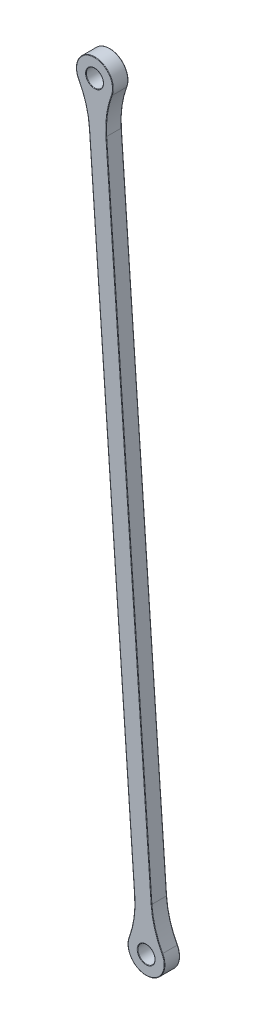
ISO-10303-21;
HEADER;
FILE_DESCRIPTION(('STEP AP214'),'2;1');
FILE_NAME('part.step','',(''),(''),'','','');
FILE_SCHEMA(('AUTOMOTIVE_DESIGN { 1 0 10303 214 1 1 1 1 }'));
ENDSEC;
DATA;
#1=APPLICATION_CONTEXT('core data for automotive mechanical design processes');
#2=APPLICATION_PROTOCOL_DEFINITION('international standard','automotive_design',2000,#1);
#3=PRODUCT_CONTEXT('',#1,'mechanical');
#4=PRODUCT('Part','Part','',(#3));
#5=PRODUCT_RELATED_PRODUCT_CATEGORY('part','',(#4));
#6=PRODUCT_DEFINITION_FORMATION('','',#4);
#7=PRODUCT_DEFINITION_CONTEXT('part definition',#1,'design');
#8=PRODUCT_DEFINITION('design','',#6,#7);
#9=PRODUCT_DEFINITION_SHAPE('','',#8);
#10=(LENGTH_UNIT() NAMED_UNIT(*) SI_UNIT(.MILLI.,.METRE.));
#11=(NAMED_UNIT(*) PLANE_ANGLE_UNIT() SI_UNIT($,.RADIAN.));
#12=(NAMED_UNIT(*) SI_UNIT($,.STERADIAN.) SOLID_ANGLE_UNIT());
#13=UNCERTAINTY_MEASURE_WITH_UNIT(LENGTH_MEASURE(1.E-05),#10,'distance_accuracy_value','');
#14=(GEOMETRIC_REPRESENTATION_CONTEXT(3) GLOBAL_UNCERTAINTY_ASSIGNED_CONTEXT((#13)) GLOBAL_UNIT_ASSIGNED_CONTEXT((#10,
#11,#12)) REPRESENTATION_CONTEXT('',''));
#15=CARTESIAN_POINT('',(0.,0.,0.));
#16=DIRECTION('',(0.,0.,1.));
#17=DIRECTION('',(1.,0.,0.));
#18=AXIS2_PLACEMENT_3D('',#15,#16,#17);
#19=CARTESIAN_POINT('',(33.0209516053081,48.5577457272989,-5.));
#20=DIRECTION('',(0.,0.,1.));
#21=DIRECTION('',(1.,0.,0.));
#22=AXIS2_PLACEMENT_3D('',#19,#20,#21);
#23=CYLINDRICAL_SURFACE('',#22,6.);
#24=DIRECTION('',(0.,0.,1.));
#25=VECTOR('',#24,1.);
#26=CARTESIAN_POINT('',(27.3940800358443,50.6406082625519,-5.));
#27=LINE('',#26,#25);
#28=CARTESIAN_POINT('',(27.3940800358443,50.6406082625519,-0.15));
#29=VERTEX_POINT('',#28);
#30=CARTESIAN_POINT('',(27.3940800358443,50.6406082625519,-4.85));
#31=VERTEX_POINT('',#30);
#32=EDGE_CURVE('E176',#29,#31,#27,.F.);
#33=ORIENTED_EDGE('',*,*,#32,.T.);
#34=CARTESIAN_POINT('',(33.0209516053081,48.5577457272989,-4.85));
#35=DIRECTION('',(0.,0.,1.));
#36=DIRECTION('',(1.,0.,0.));
#37=AXIS2_PLACEMENT_3D('',#34,#35,#36);
#38=CIRCLE('',#37,6.);
#39=CARTESIAN_POINT('',(38.3004072020363,51.4085962323544,-4.85));
#40=VERTEX_POINT('',#39);
#41=EDGE_CURVE('E235',#31,#40,#38,.T.);
#42=ORIENTED_EDGE('',*,*,#41,.T.);
#43=DIRECTION('',(0.,0.,1.));
#44=VECTOR('',#43,1.);
#45=CARTESIAN_POINT('',(38.3004072020363,51.4085962323544,-5.));
#46=LINE('',#45,#44);
#47=CARTESIAN_POINT('',(38.3004072020363,51.4085962323544,-0.15));
#48=VERTEX_POINT('',#47);
#49=EDGE_CURVE('E307',#40,#48,#46,.T.);
#50=ORIENTED_EDGE('',*,*,#49,.T.);
#51=CARTESIAN_POINT('',(33.0209516053081,48.5577457272989,-0.15));
#52=DIRECTION('',(0.,0.,1.));
#53=DIRECTION('',(1.,0.,0.));
#54=AXIS2_PLACEMENT_3D('',#51,#52,#53);
#55=CIRCLE('',#54,6.);
#56=EDGE_CURVE('E233',#48,#29,#55,.F.);
#57=ORIENTED_EDGE('',*,*,#56,.T.);
#58=EDGE_LOOP('',(#33,#42,#50,#57));
#59=FACE_BOUND('',#58,.T.);
#60=ADVANCED_FACE('F41',(#59),#23,.T.);
#61=CARTESIAN_POINT('',(33.4673478601874,2.35666142654259,-5.));
#62=DIRECTION('',(0.997529923737068,0.070242802116079,0.));
#63=DIRECTION('',(-0.070242802116079,0.997529923737068,0.));
#64=AXIS2_PLACEMENT_3D('',#61,#62,#63);
#65=PLANE('',#64);
#66=DIRECTION('',(0.,0.,1.));
#67=VECTOR('',#66,1.);
#68=CARTESIAN_POINT('',(14.4118432291919,272.967108457345,-5.));
#69=LINE('',#68,#67);
#70=CARTESIAN_POINT('',(14.4118432291919,272.967108457345,-0.15));
#71=VERTEX_POINT('',#70);
#72=CARTESIAN_POINT('',(14.4118432291919,272.967108457345,-4.85));
#73=VERTEX_POINT('',#72);
#74=EDGE_CURVE('E312',#71,#73,#69,.F.);
#75=ORIENTED_EDGE('',*,*,#74,.T.);
#76=DIRECTION('',(-0.070242802116079,0.997529923737068,0.));
#77=VECTOR('',#76,1.);
#78=CARTESIAN_POINT('',(33.4673478601874,2.35666142654259,-4.85));
#79=LINE('',#78,#77);
#80=CARTESIAN_POINT('',(29.1856199006377,63.1622050022993,-4.85));
#81=VERTEX_POINT('',#80);
#82=EDGE_CURVE('E227',#73,#81,#79,.F.);
#83=ORIENTED_EDGE('',*,*,#82,.T.);
#84=DIRECTION('',(0.,0.,1.));
#85=VECTOR('',#84,1.);
#86=CARTESIAN_POINT('',(29.1856199006377,63.1622050022993,-5.));
#87=LINE('',#86,#85);
#88=CARTESIAN_POINT('',(29.1856199006377,63.1622050022993,-0.15));
#89=VERTEX_POINT('',#88);
#90=EDGE_CURVE('E316',#81,#89,#87,.T.);
#91=ORIENTED_EDGE('',*,*,#90,.T.);
#92=DIRECTION('',(-0.070242802116079,0.997529923737068,0.));
#93=VECTOR('',#92,1.);
#94=CARTESIAN_POINT('',(14.4118432291919,272.967108457345,-0.15));
#95=LINE('',#94,#93);
#96=EDGE_CURVE('E225',#89,#71,#95,.T.);
#97=ORIENTED_EDGE('',*,*,#96,.T.);
#98=EDGE_LOOP('',(#75,#83,#91,#97));
#99=FACE_BOUND('',#98,.T.);
#100=ADVANCED_FACE('F353',(#99),#65,.F.);
#101=CARTESIAN_POINT('',(16.1626790974491,287.964927424195,-5.));
#102=DIRECTION('',(0.,0.,1.));
#103=DIRECTION('',(1.,0.,0.));
#104=AXIS2_PLACEMENT_3D('',#101,#102,#103);
#105=CYLINDRICAL_SURFACE('',#104,6.);
#106=DIRECTION('',(0.,0.,1.));
#107=VECTOR('',#106,1.);
#108=CARTESIAN_POINT('',(21.7895506669129,285.882064888942,-5.));
#109=LINE('',#108,#107);
#110=CARTESIAN_POINT('',(21.7895506669129,285.882064888942,-0.15));
#111=VERTEX_POINT('',#110);
#112=CARTESIAN_POINT('',(21.7895506669129,285.882064888942,-4.85));
#113=VERTEX_POINT('',#112);
#114=EDGE_CURVE('E347',#111,#113,#109,.F.);
#115=ORIENTED_EDGE('',*,*,#114,.T.);
#116=CARTESIAN_POINT('',(16.1626790974491,287.964927424195,-4.85));
#117=DIRECTION('',(0.,0.,1.));
#118=DIRECTION('',(1.,0.,0.));
#119=AXIS2_PLACEMENT_3D('',#116,#117,#118);
#120=CIRCLE('',#119,6.);
#121=CARTESIAN_POINT('',(10.8832235007209,285.11407691914,-4.85));
#122=VERTEX_POINT('',#121);
#123=EDGE_CURVE('E218',#113,#122,#120,.T.);
#124=ORIENTED_EDGE('',*,*,#123,.T.);
#125=DIRECTION('',(0.,0.,1.));
#126=VECTOR('',#125,1.);
#127=CARTESIAN_POINT('',(10.8832235007209,285.11407691914,-5.));
#128=LINE('',#127,#126);
#129=CARTESIAN_POINT('',(10.8832235007209,285.11407691914,-0.15));
#130=VERTEX_POINT('',#129);
#131=EDGE_CURVE('E342',#122,#130,#128,.T.);
#132=ORIENTED_EDGE('',*,*,#131,.T.);
#133=CARTESIAN_POINT('',(16.1626790974491,287.964927424195,-0.15));
#134=DIRECTION('',(0.,0.,1.));
#135=DIRECTION('',(1.,0.,0.));
#136=AXIS2_PLACEMENT_3D('',#133,#134,#135);
#137=CIRCLE('',#136,6.);
#138=EDGE_CURVE('E216',#130,#111,#137,.F.);
#139=ORIENTED_EDGE('',*,*,#138,.T.);
#140=EDGE_LOOP('',(#115,#124,#132,#139));
#141=FACE_BOUND('',#140,.T.);
#142=ADVANCED_FACE('F377',(#141),#105,.T.);
#143=CARTESIAN_POINT('',(16.1626790974491,287.964927424195,-5.));
#144=DIRECTION('',(0.,0.,1.));
#145=DIRECTION('',(1.,0.,0.));
#146=AXIS2_PLACEMENT_3D('',#143,#144,#145);
#147=CYLINDRICAL_SURFACE('',#146,2.8);
#148=CARTESIAN_POINT('',(16.1626790974491,287.964927424195,-4.85));
#149=DIRECTION('',(0.,0.,1.));
#150=DIRECTION('',(1.,0.,0.));
#151=AXIS2_PLACEMENT_3D('',#148,#149,#150);
#152=CIRCLE('',#151,2.8);
#153=CARTESIAN_POINT('',(18.9626790974491,287.964927424195,-4.85));
#154=VERTEX_POINT('',#153);
#155=EDGE_CURVE('E202',#154,#154,#152,.F.);
#156=ORIENTED_EDGE('',*,*,#155,.T.);
#157=EDGE_LOOP('',(#156));
#158=FACE_BOUND('',#157,.T.);
#159=CARTESIAN_POINT('',(16.1626790974491,287.964927424195,-0.15));
#160=DIRECTION('',(0.,0.,1.));
#161=DIRECTION('',(1.,0.,0.));
#162=AXIS2_PLACEMENT_3D('',#159,#160,#161);
#163=CIRCLE('',#162,2.8);
#164=CARTESIAN_POINT('',(18.9626790974491,287.964927424195,-0.15));
#165=VERTEX_POINT('',#164);
#166=EDGE_CURVE('E199',#165,#165,#163,.T.);
#167=ORIENTED_EDGE('',*,*,#166,.T.);
#168=EDGE_LOOP('',(#167));
#169=FACE_BOUND('',#168,.T.);
#170=ADVANCED_FACE('F646',(#158,#169),#147,.F.);
#171=CARTESIAN_POINT('',(39.053515433115,2.75002111839263,-5.));
#172=DIRECTION('',(0.997529923737068,0.070242802116079,0.));
#173=DIRECTION('',(-0.070242802116079,0.997529923737068,0.));
#174=AXIS2_PLACEMENT_3D('',#171,#172,#173);
#175=PLANE('',#174);
#176=DIRECTION('',(0.,0.,-1.));
#177=VECTOR('',#176,1.);
#178=CARTESIAN_POINT('',(34.7717874735652,63.5555646941496,-5.));
#179=LINE('',#178,#177);
#180=CARTESIAN_POINT('',(34.7717874735652,63.5555646941496,-0.15));
#181=VERTEX_POINT('',#180);
#182=CARTESIAN_POINT('',(34.7717874735652,63.5555646941496,-4.85));
#183=VERTEX_POINT('',#182);
#184=EDGE_CURVE('E270',#181,#183,#179,.T.);
#185=ORIENTED_EDGE('',*,*,#184,.T.);
#186=DIRECTION('',(-0.070242802116079,0.997529923737068,0.));
#187=VECTOR('',#186,1.);
#188=CARTESIAN_POINT('',(19.9980108021194,273.360468149195,-4.85));
#189=LINE('',#188,#187);
#190=CARTESIAN_POINT('',(19.9980108021194,273.360468149195,-4.85));
#191=VERTEX_POINT('',#190);
#192=EDGE_CURVE('E210',#183,#191,#189,.T.);
#193=ORIENTED_EDGE('',*,*,#192,.T.);
#194=DIRECTION('',(0.,0.,-1.));
#195=VECTOR('',#194,1.);
#196=CARTESIAN_POINT('',(19.9980108021194,273.360468149195,0.));
#197=LINE('',#196,#195);
#198=CARTESIAN_POINT('',(19.9980108021194,273.360468149195,-0.15));
#199=VERTEX_POINT('',#198);
#200=EDGE_CURVE('E340',#191,#199,#197,.F.);
#201=ORIENTED_EDGE('',*,*,#200,.T.);
#202=DIRECTION('',(-0.070242802116079,0.997529923737068,0.));
#203=VECTOR('',#202,1.);
#204=CARTESIAN_POINT('',(39.053515433115,2.75002111839263,-0.15));
#205=LINE('',#204,#203);
#206=EDGE_CURVE('E208',#199,#181,#205,.F.);
#207=ORIENTED_EDGE('',*,*,#206,.T.);
#208=EDGE_LOOP('',(#185,#193,#201,#207));
#209=FACE_BOUND('',#208,.T.);
#210=ADVANCED_FACE('F339',(#209),#175,.T.);
#211=CARTESIAN_POINT('',(33.0209516053081,48.5577457272989,-5.));
#212=DIRECTION('',(0.,0.,1.));
#213=DIRECTION('',(1.,0.,0.));
#214=AXIS2_PLACEMENT_3D('',#211,#212,#213);
#215=CYLINDRICAL_SURFACE('',#214,2.8);
#216=CARTESIAN_POINT('',(33.0209516053081,48.5577457272989,-4.85));
#217=DIRECTION('',(0.,0.,1.));
#218=DIRECTION('',(1.,0.,0.));
#219=AXIS2_PLACEMENT_3D('',#216,#217,#218);
#220=CIRCLE('',#219,2.8);
#221=CARTESIAN_POINT('',(35.8209516053081,48.5577457272989,-4.85));
#222=VERTEX_POINT('',#221);
#223=EDGE_CURVE('E196',#222,#222,#220,.F.);
#224=ORIENTED_EDGE('',*,*,#223,.T.);
#225=EDGE_LOOP('',(#224));
#226=FACE_BOUND('',#225,.T.);
#227=CARTESIAN_POINT('',(33.0209516053081,48.5577457272989,-0.15));
#228=DIRECTION('',(0.,0.,1.));
#229=DIRECTION('',(1.,0.,0.));
#230=AXIS2_PLACEMENT_3D('',#227,#228,#229);
#231=CIRCLE('',#230,2.8);
#232=CARTESIAN_POINT('',(35.8209516053081,48.5577457272989,-0.15));
#233=VERTEX_POINT('',#232);
#234=EDGE_CURVE('E193',#233,#233,#231,.T.);
#235=ORIENTED_EDGE('',*,*,#234,.T.);
#236=EDGE_LOOP('',(#235));
#237=FACE_BOUND('',#236,.T.);
#238=ADVANCED_FACE('F623',(#226,#237),#215,.F.);
#239=CARTESIAN_POINT('',(0.,0.,-5.));
#240=DIRECTION('',(0.,0.,1.));
#241=DIRECTION('',(1.,0.,0.));
#242=AXIS2_PLACEMENT_3D('',#239,#240,#241);
#243=PLANE('',#242);
#244=CARTESIAN_POINT('',(33.0209516053081,48.5577457272989,-5.));
#245=DIRECTION('',(0.,0.,1.));
#246=DIRECTION('',(1.,0.,0.));
#247=AXIS2_PLACEMENT_3D('',#244,#245,#246);
#248=CIRCLE('',#247,2.95);
#249=CARTESIAN_POINT('',(35.9709516053081,48.5577457272989,-5.));
#250=VERTEX_POINT('',#249);
#251=EDGE_CURVE('E185',#250,#250,#248,.T.);
#252=ORIENTED_EDGE('',*,*,#251,.T.);
#253=EDGE_LOOP('',(#252));
#254=FACE_BOUND('',#253,.T.);
#255=CARTESIAN_POINT('',(16.1626790974491,287.964927424195,-5.));
#256=DIRECTION('',(0.,0.,1.));
#257=DIRECTION('',(1.,0.,0.));
#258=AXIS2_PLACEMENT_3D('',#255,#256,#257);
#259=CIRCLE('',#258,2.95);
#260=CARTESIAN_POINT('',(19.1126790974491,287.964927424195,-5.));
#261=VERTEX_POINT('',#260);
#262=EDGE_CURVE('E182',#261,#261,#259,.T.);
#263=ORIENTED_EDGE('',*,*,#262,.T.);
#264=EDGE_LOOP('',(#263));
#265=FACE_BOUND('',#264,.T.);
#266=DIRECTION('',(-0.070242802116079,0.997529923737068,0.));
#267=VECTOR('',#266,1.);
#268=CARTESIAN_POINT('',(34.6221579850047,63.5450282738321,-5.));
#269=LINE('',#268,#267);
#270=CARTESIAN_POINT('',(19.8483813135589,273.349931728877,-5.));
#271=VERTEX_POINT('',#270);
#272=CARTESIAN_POINT('',(34.6221579850047,63.5450282738321,-5.));
#273=VERTEX_POINT('',#272);
#274=EDGE_CURVE('E180',#271,#273,#269,.F.);
#275=ORIENTED_EDGE('',*,*,#274,.T.);
#276=CARTESIAN_POINT('',(64.6976851856773,65.6628487576319,-5.));
#277=DIRECTION('',(0.,0.,1.));
#278=DIRECTION('',(1.,0.,0.));
#279=AXIS2_PLACEMENT_3D('',#276,#277,#278);
#280=CIRCLE('',#279,30.15);
#281=CARTESIAN_POINT('',(38.1684208121181,51.337324969728,-5.));
#282=VERTEX_POINT('',#281);
#283=EDGE_CURVE('E161',#273,#282,#280,.T.);
#284=ORIENTED_EDGE('',*,*,#283,.T.);
#285=CARTESIAN_POINT('',(33.0209516053081,48.5577457272989,-5.));
#286=DIRECTION('',(0.,0.,1.));
#287=DIRECTION('',(1.,0.,0.));
#288=AXIS2_PLACEMENT_3D('',#285,#286,#287);
#289=CIRCLE('',#288,5.85);
#290=CARTESIAN_POINT('',(27.5347518250809,50.5885366991706,-5.));
#291=VERTEX_POINT('',#290);
#292=EDGE_CURVE('E169',#282,#291,#289,.F.);
#293=ORIENTED_EDGE('',*,*,#292,.T.);
#294=CARTESIAN_POINT('',(-0.740277811474392,61.054920938817,-5.));
#295=DIRECTION('',(0.,0.,1.));
#296=DIRECTION('',(1.,0.,0.));
#297=AXIS2_PLACEMENT_3D('',#294,#295,#296);
#298=CIRCLE('',#297,30.15);
#299=CARTESIAN_POINT('',(29.3352493891982,63.1727414226168,-5.));
#300=VERTEX_POINT('',#299);
#301=EDGE_CURVE('E175',#291,#300,#298,.T.);
#302=ORIENTED_EDGE('',*,*,#301,.T.);
#303=DIRECTION('',(-0.070242802116079,0.997529923737068,0.));
#304=VECTOR('',#303,1.);
#305=CARTESIAN_POINT('',(33.6169773487479,2.36719784686,-5.));
#306=LINE('',#305,#304);
#307=CARTESIAN_POINT('',(14.5614727177524,272.977644877662,-5.));
#308=VERTEX_POINT('',#307);
#309=EDGE_CURVE('E321',#300,#308,#306,.T.);
#310=ORIENTED_EDGE('',*,*,#309,.T.);
#311=CARTESIAN_POINT('',(-15.5140544829202,270.859824393862,-5.));
#312=DIRECTION('',(0.,0.,1.));
#313=DIRECTION('',(1.,0.,0.));
#314=AXIS2_PLACEMENT_3D('',#311,#312,#313);
#315=CIRCLE('',#314,30.15);
#316=CARTESIAN_POINT('',(11.0152098906391,285.185348181766,-5.));
#317=VERTEX_POINT('',#316);
#318=EDGE_CURVE('E323',#308,#317,#315,.T.);
#319=ORIENTED_EDGE('',*,*,#318,.T.);
#320=CARTESIAN_POINT('',(16.1626790974491,287.964927424195,-5.));
#321=DIRECTION('',(0.,0.,1.));
#322=DIRECTION('',(1.,0.,0.));
#323=AXIS2_PLACEMENT_3D('',#320,#321,#322);
#324=CIRCLE('',#323,5.85);
#325=CARTESIAN_POINT('',(21.6488788776763,285.934136452324,-5.));
#326=VERTEX_POINT('',#325);
#327=EDGE_CURVE('E325',#317,#326,#324,.F.);
#328=ORIENTED_EDGE('',*,*,#327,.T.);
#329=CARTESIAN_POINT('',(49.9239085142315,275.467752212677,-5.));
#330=DIRECTION('',(0.,0.,1.));
#331=DIRECTION('',(1.,0.,0.));
#332=AXIS2_PLACEMENT_3D('',#329,#330,#331);
#333=CIRCLE('',#332,30.15);
#334=EDGE_CURVE('E187',#326,#271,#333,.T.);
#335=ORIENTED_EDGE('',*,*,#334,.T.);
#336=EDGE_LOOP('',(#275,#284,#293,#302,#310,#319,#328,#335));
#337=FACE_BOUND('',#336,.T.);
#338=ADVANCED_FACE('F178',(#254,#265,#337),#243,.F.);
#339=CARTESIAN_POINT('',(0.,0.,0.));
#340=DIRECTION('',(0.,0.,1.));
#341=DIRECTION('',(1.,0.,0.));
#342=AXIS2_PLACEMENT_3D('',#339,#340,#341);
#343=PLANE('',#342);
#344=CARTESIAN_POINT('',(33.0209516053081,48.5577457272989,0.));
#345=DIRECTION('',(0.,0.,1.));
#346=DIRECTION('',(1.,0.,0.));
#347=AXIS2_PLACEMENT_3D('',#344,#345,#346);
#348=CIRCLE('',#347,2.95);
#349=CARTESIAN_POINT('',(35.9709516053081,48.5577457272989,0.));
#350=VERTEX_POINT('',#349);
#351=EDGE_CURVE('E11',#350,#350,#348,.F.);
#352=ORIENTED_EDGE('',*,*,#351,.T.);
#353=EDGE_LOOP('',(#352));
#354=FACE_BOUND('',#353,.T.);
#355=CARTESIAN_POINT('',(16.1626790974491,287.964927424195,0.));
#356=DIRECTION('',(0.,0.,1.));
#357=DIRECTION('',(1.,0.,0.));
#358=AXIS2_PLACEMENT_3D('',#355,#356,#357);
#359=CIRCLE('',#358,2.95);
#360=CARTESIAN_POINT('',(19.1126790974491,287.964927424195,0.));
#361=VERTEX_POINT('',#360);
#362=EDGE_CURVE('E50',#361,#361,#359,.F.);
#363=ORIENTED_EDGE('',*,*,#362,.T.);
#364=EDGE_LOOP('',(#363));
#365=FACE_BOUND('',#364,.T.);
#366=CARTESIAN_POINT('',(16.1626790974491,287.964927424195,0.));
#367=DIRECTION('',(0.,0.,1.));
#368=DIRECTION('',(1.,0.,0.));
#369=AXIS2_PLACEMENT_3D('',#366,#367,#368);
#370=CIRCLE('',#369,5.85);
#371=CARTESIAN_POINT('',(21.6488788776762,285.934136452324,0.));
#372=VERTEX_POINT('',#371);
#373=CARTESIAN_POINT('',(11.0152098906391,285.185348181766,0.));
#374=VERTEX_POINT('',#373);
#375=EDGE_CURVE('E58',#372,#374,#370,.T.);
#376=ORIENTED_EDGE('',*,*,#375,.T.);
#377=CARTESIAN_POINT('',(-15.5140544829202,270.859824393862,0.));
#378=DIRECTION('',(0.,0.,1.));
#379=DIRECTION('',(1.,0.,0.));
#380=AXIS2_PLACEMENT_3D('',#377,#378,#379);
#381=CIRCLE('',#380,30.15);
#382=CARTESIAN_POINT('',(14.5614727177524,272.977644877662,0.));
#383=VERTEX_POINT('',#382);
#384=EDGE_CURVE('E249',#374,#383,#381,.F.);
#385=ORIENTED_EDGE('',*,*,#384,.T.);
#386=DIRECTION('',(-0.070242802116079,0.997529923737068,0.));
#387=VECTOR('',#386,1.);
#388=CARTESIAN_POINT('',(29.3352493891982,63.1727414226168,0.));
#389=LINE('',#388,#387);
#390=CARTESIAN_POINT('',(29.3352493891982,63.1727414226168,0.));
#391=VERTEX_POINT('',#390);
#392=EDGE_CURVE('E237',#383,#391,#389,.F.);
#393=ORIENTED_EDGE('',*,*,#392,.T.);
#394=CARTESIAN_POINT('',(-0.740277811474392,61.054920938817,0.));
#395=DIRECTION('',(0.,0.,1.));
#396=DIRECTION('',(1.,0.,0.));
#397=AXIS2_PLACEMENT_3D('',#394,#395,#396);
#398=CIRCLE('',#397,30.15);
#399=CARTESIAN_POINT('',(27.5347518250809,50.5885366991706,0.));
#400=VERTEX_POINT('',#399);
#401=EDGE_CURVE('E239',#391,#400,#398,.F.);
#402=ORIENTED_EDGE('',*,*,#401,.T.);
#403=CARTESIAN_POINT('',(33.0209516053081,48.5577457272989,0.));
#404=DIRECTION('',(0.,0.,1.));
#405=DIRECTION('',(1.,0.,0.));
#406=AXIS2_PLACEMENT_3D('',#403,#404,#405);
#407=CIRCLE('',#406,5.85);
#408=CARTESIAN_POINT('',(38.1684208121181,51.337324969728,0.));
#409=VERTEX_POINT('',#408);
#410=EDGE_CURVE('E241',#400,#409,#407,.T.);
#411=ORIENTED_EDGE('',*,*,#410,.T.);
#412=CARTESIAN_POINT('',(64.6976851856773,65.6628487576319,0.));
#413=DIRECTION('',(0.,0.,1.));
#414=DIRECTION('',(1.,0.,0.));
#415=AXIS2_PLACEMENT_3D('',#412,#413,#414);
#416=CIRCLE('',#415,30.15);
#417=CARTESIAN_POINT('',(34.6221579850047,63.5450282738321,0.));
#418=VERTEX_POINT('',#417);
#419=EDGE_CURVE('E243',#409,#418,#416,.F.);
#420=ORIENTED_EDGE('',*,*,#419,.T.);
#421=DIRECTION('',(-0.070242802116079,0.997529923737068,0.));
#422=VECTOR('',#421,1.);
#423=CARTESIAN_POINT('',(38.9038859445544,2.73948469807522,0.));
#424=LINE('',#423,#422);
#425=CARTESIAN_POINT('',(19.8483813135589,273.349931728877,0.));
#426=VERTEX_POINT('',#425);
#427=EDGE_CURVE('E245',#418,#426,#424,.T.);
#428=ORIENTED_EDGE('',*,*,#427,.T.);
#429=CARTESIAN_POINT('',(49.9239085142315,275.467752212677,0.));
#430=DIRECTION('',(0.,0.,1.));
#431=DIRECTION('',(1.,0.,0.));
#432=AXIS2_PLACEMENT_3D('',#429,#430,#431);
#433=CIRCLE('',#432,30.15);
#434=EDGE_CURVE('E63',#426,#372,#433,.F.);
#435=ORIENTED_EDGE('',*,*,#434,.T.);
#436=EDGE_LOOP('',(#376,#385,#393,#402,#411,#420,#428,#435));
#437=FACE_BOUND('',#436,.T.);
#438=ADVANCED_FACE('F396',(#354,#365,#437),#343,.T.);
#439=CARTESIAN_POINT('',(49.9239085142315,275.467752212677,-5.));
#440=DIRECTION('',(0.,0.,1.));
#441=DIRECTION('',(1.,0.,0.));
#442=AXIS2_PLACEMENT_3D('',#439,#440,#441);
#443=CYLINDRICAL_SURFACE('',#442,30.);
#444=ORIENTED_EDGE('',*,*,#200,.F.);
#445=CARTESIAN_POINT('',(49.9239085142315,275.467752212677,-4.85));
#446=DIRECTION('',(0.,0.,1.));
#447=DIRECTION('',(1.,0.,0.));
#448=AXIS2_PLACEMENT_3D('',#445,#446,#447);
#449=CIRCLE('',#448,30.);
#450=EDGE_CURVE('E214',#191,#113,#449,.F.);
#451=ORIENTED_EDGE('',*,*,#450,.T.);
#452=ORIENTED_EDGE('',*,*,#114,.F.);
#453=CARTESIAN_POINT('',(49.9239085142315,275.467752212677,-0.15));
#454=DIRECTION('',(0.,0.,1.));
#455=DIRECTION('',(1.,0.,0.));
#456=AXIS2_PLACEMENT_3D('',#453,#454,#455);
#457=CIRCLE('',#456,30.);
#458=EDGE_CURVE('E212',#111,#199,#457,.T.);
#459=ORIENTED_EDGE('',*,*,#458,.T.);
#460=EDGE_LOOP('',(#444,#451,#452,#459));
#461=FACE_BOUND('',#460,.T.);
#462=ADVANCED_FACE('F419',(#461),#443,.F.);
#463=CARTESIAN_POINT('',(-15.5140544829202,270.859824393862,-5.));
#464=DIRECTION('',(0.,0.,1.));
#465=DIRECTION('',(1.,0.,0.));
#466=AXIS2_PLACEMENT_3D('',#463,#464,#465);
#467=CYLINDRICAL_SURFACE('',#466,30.);
#468=ORIENTED_EDGE('',*,*,#131,.F.);
#469=CARTESIAN_POINT('',(-15.5140544829202,270.859824393862,-4.85));
#470=DIRECTION('',(0.,0.,1.));
#471=DIRECTION('',(1.,0.,0.));
#472=AXIS2_PLACEMENT_3D('',#469,#470,#471);
#473=CIRCLE('',#472,30.);
#474=EDGE_CURVE('E223',#122,#73,#473,.F.);
#475=ORIENTED_EDGE('',*,*,#474,.T.);
#476=ORIENTED_EDGE('',*,*,#74,.F.);
#477=CARTESIAN_POINT('',(-15.5140544829202,270.859824393862,-0.15));
#478=DIRECTION('',(0.,0.,1.));
#479=DIRECTION('',(1.,0.,0.));
#480=AXIS2_PLACEMENT_3D('',#477,#478,#479);
#481=CIRCLE('',#480,30.);
#482=EDGE_CURVE('E220',#71,#130,#481,.T.);
#483=ORIENTED_EDGE('',*,*,#482,.T.);
#484=EDGE_LOOP('',(#468,#475,#476,#483));
#485=FACE_BOUND('',#484,.T.);
#486=ADVANCED_FACE('F374',(#485),#467,.F.);
#487=CARTESIAN_POINT('',(-0.740277811474392,61.054920938817,-5.));
#488=DIRECTION('',(0.,0.,1.));
#489=DIRECTION('',(1.,0.,0.));
#490=AXIS2_PLACEMENT_3D('',#487,#488,#489);
#491=CYLINDRICAL_SURFACE('',#490,30.);
#492=ORIENTED_EDGE('',*,*,#90,.F.);
#493=CARTESIAN_POINT('',(-0.740277811474392,61.054920938817,-4.85));
#494=DIRECTION('',(0.,0.,1.));
#495=DIRECTION('',(1.,0.,0.));
#496=AXIS2_PLACEMENT_3D('',#493,#494,#495);
#497=CIRCLE('',#496,30.);
#498=EDGE_CURVE('E231',#81,#31,#497,.F.);
#499=ORIENTED_EDGE('',*,*,#498,.T.);
#500=ORIENTED_EDGE('',*,*,#32,.F.);
#501=CARTESIAN_POINT('',(-0.740277811474392,61.054920938817,-0.15));
#502=DIRECTION('',(0.,0.,1.));
#503=DIRECTION('',(1.,0.,0.));
#504=AXIS2_PLACEMENT_3D('',#501,#502,#503);
#505=CIRCLE('',#504,30.);
#506=EDGE_CURVE('E229',#29,#89,#505,.T.);
#507=ORIENTED_EDGE('',*,*,#506,.T.);
#508=EDGE_LOOP('',(#492,#499,#500,#507));
#509=FACE_BOUND('',#508,.T.);
#510=ADVANCED_FACE('F393',(#509),#491,.F.);
#511=CARTESIAN_POINT('',(64.6976851856773,65.6628487576319,-5.));
#512=DIRECTION('',(0.,0.,1.));
#513=DIRECTION('',(1.,0.,0.));
#514=AXIS2_PLACEMENT_3D('',#511,#512,#513);
#515=CYLINDRICAL_SURFACE('',#514,30.);
#516=ORIENTED_EDGE('',*,*,#49,.F.);
#517=CARTESIAN_POINT('',(64.6976851856773,65.6628487576319,-4.85));
#518=DIRECTION('',(0.,0.,1.));
#519=DIRECTION('',(1.,0.,0.));
#520=AXIS2_PLACEMENT_3D('',#517,#518,#519);
#521=CIRCLE('',#520,30.);
#522=EDGE_CURVE('E163',#40,#183,#521,.F.);
#523=ORIENTED_EDGE('',*,*,#522,.T.);
#524=ORIENTED_EDGE('',*,*,#184,.F.);
#525=CARTESIAN_POINT('',(64.6976851856773,65.6628487576319,-0.15));
#526=DIRECTION('',(0.,0.,1.));
#527=DIRECTION('',(1.,0.,0.));
#528=AXIS2_PLACEMENT_3D('',#525,#526,#527);
#529=CIRCLE('',#528,30.);
#530=EDGE_CURVE('E205',#181,#48,#529,.T.);
#531=ORIENTED_EDGE('',*,*,#530,.T.);
#532=EDGE_LOOP('',(#516,#523,#524,#531));
#533=FACE_BOUND('',#532,.T.);
#534=ADVANCED_FACE('F306',(#533),#515,.F.);
#535=CARTESIAN_POINT('',(33.0209516053081,48.5577457272989,-4.85));
#536=DIRECTION('',(0.,0.,1.));
#537=DIRECTION('',(1.,0.,0.));
#538=AXIS2_PLACEMENT_3D('',#535,#536,#537);
#539=TOROIDAL_SURFACE('',#538,2.95,0.15);
#540=ORIENTED_EDGE('',*,*,#223,.F.);
#541=EDGE_LOOP('',(#540));
#542=FACE_BOUND('',#541,.T.);
#543=ORIENTED_EDGE('',*,*,#251,.F.);
#544=EDGE_LOOP('',(#543));
#545=FACE_BOUND('',#544,.T.);
#546=ADVANCED_FACE('F429',(#542,#545),#539,.T.);
#547=CARTESIAN_POINT('',(16.1626790974491,287.964927424195,-4.85));
#548=DIRECTION('',(0.,0.,1.));
#549=DIRECTION('',(1.,0.,0.));
#550=AXIS2_PLACEMENT_3D('',#547,#548,#549);
#551=TOROIDAL_SURFACE('',#550,2.95,0.15);
#552=ORIENTED_EDGE('',*,*,#155,.F.);
#553=EDGE_LOOP('',(#552));
#554=FACE_BOUND('',#553,.T.);
#555=ORIENTED_EDGE('',*,*,#262,.F.);
#556=EDGE_LOOP('',(#555));
#557=FACE_BOUND('',#556,.T.);
#558=ADVANCED_FACE('F432',(#554,#557),#551,.T.);
#559=CARTESIAN_POINT('',(-15.5140544829202,270.859824393862,-4.85));
#560=DIRECTION('',(0.,0.,1.));
#561=DIRECTION('',(1.,0.,0.));
#562=AXIS2_PLACEMENT_3D('',#559,#560,#561);
#563=TOROIDAL_SURFACE('',#562,30.15,0.15);
#564=CARTESIAN_POINT('',(14.5614727177524,272.977644877662,-4.85));
#565=DIRECTION('',(0.0702428021159834,-0.997529923737075,0.));
#566=DIRECTION('',(0.997529923737075,0.0702428021159834,0.));
#567=AXIS2_PLACEMENT_3D('',#564,#565,#566);
#568=CIRCLE('',#567,0.15);
#569=EDGE_CURVE('E264',#73,#308,#568,.T.);
#570=ORIENTED_EDGE('',*,*,#569,.F.);
#571=ORIENTED_EDGE('',*,*,#474,.F.);
#572=CARTESIAN_POINT('',(11.0152098906391,285.185348181766,-4.85));
#573=DIRECTION('',(-0.475141750842693,0.879909266121309,0.));
#574=DIRECTION('',(-0.879909266121309,-0.475141750842693,0.));
#575=AXIS2_PLACEMENT_3D('',#572,#573,#574);
#576=CIRCLE('',#575,0.15);
#577=EDGE_CURVE('E267',#317,#122,#576,.T.);
#578=ORIENTED_EDGE('',*,*,#577,.F.);
#579=ORIENTED_EDGE('',*,*,#318,.F.);
#580=EDGE_LOOP('',(#570,#571,#578,#579));
#581=FACE_BOUND('',#580,.T.);
#582=ADVANCED_FACE('F386',(#581),#563,.T.);
#583=CARTESIAN_POINT('',(16.1626790974491,287.964927424195,-4.85));
#584=DIRECTION('',(0.,0.,1.));
#585=DIRECTION('',(1.,0.,0.));
#586=AXIS2_PLACEMENT_3D('',#583,#584,#585);
#587=TOROIDAL_SURFACE('',#586,5.85,0.15);
#588=ORIENTED_EDGE('',*,*,#577,.T.);
#589=ORIENTED_EDGE('',*,*,#123,.F.);
#590=CARTESIAN_POINT('',(21.6488788776763,285.934136452324,-4.85));
#591=DIRECTION('',(-0.347143755875526,-0.937811928243949,0.));
#592=DIRECTION('',(0.937811928243949,-0.347143755875526,0.));
#593=AXIS2_PLACEMENT_3D('',#590,#591,#592);
#594=CIRCLE('',#593,0.15);
#595=EDGE_CURVE('E261',#326,#113,#594,.T.);
#596=ORIENTED_EDGE('',*,*,#595,.F.);
#597=ORIENTED_EDGE('',*,*,#327,.F.);
#598=EDGE_LOOP('',(#588,#589,#596,#597));
#599=FACE_BOUND('',#598,.T.);
#600=ADVANCED_FACE('F381',(#599),#587,.T.);
#601=CARTESIAN_POINT('',(33.6169773487479,2.36719784686,-4.85));
#602=DIRECTION('',(-0.070242802116079,0.997529923737068,0.));
#603=DIRECTION('',(-0.997529923737068,-0.070242802116079,0.));
#604=AXIS2_PLACEMENT_3D('',#601,#602,#603);
#605=CYLINDRICAL_SURFACE('',#604,0.15);
#606=ORIENTED_EDGE('',*,*,#569,.T.);
#607=ORIENTED_EDGE('',*,*,#309,.F.);
#608=CARTESIAN_POINT('',(29.3352493891982,63.1727414226168,-4.85));
#609=DIRECTION('',(0.0702428021160746,-0.997529923737069,0.));
#610=DIRECTION('',(0.997529923737069,0.0702428021160747,0.));
#611=AXIS2_PLACEMENT_3D('',#608,#609,#610);
#612=CIRCLE('',#611,0.15);
#613=EDGE_CURVE('E258',#81,#300,#612,.T.);
#614=ORIENTED_EDGE('',*,*,#613,.F.);
#615=ORIENTED_EDGE('',*,*,#82,.F.);
#616=EDGE_LOOP('',(#606,#607,#614,#615));
#617=FACE_BOUND('',#616,.T.);
#618=ADVANCED_FACE('F389',(#617),#605,.T.);
#619=CARTESIAN_POINT('',(49.9239085142315,275.467752212677,-4.85));
#620=DIRECTION('',(0.,0.,1.));
#621=DIRECTION('',(1.,0.,0.));
#622=AXIS2_PLACEMENT_3D('',#619,#620,#621);
#623=TOROIDAL_SURFACE('',#622,30.15,0.15);
#624=ORIENTED_EDGE('',*,*,#595,.T.);
#625=ORIENTED_EDGE('',*,*,#450,.F.);
#626=CARTESIAN_POINT('',(19.8483813135589,273.349931728877,-4.85));
#627=DIRECTION('',(0.0702428021159842,-0.997529923737075,0.));
#628=DIRECTION('',(0.997529923737075,0.0702428021159842,0.));
#629=AXIS2_PLACEMENT_3D('',#626,#627,#628);
#630=CIRCLE('',#629,0.15);
#631=EDGE_CURVE('E255',#271,#191,#630,.T.);
#632=ORIENTED_EDGE('',*,*,#631,.F.);
#633=ORIENTED_EDGE('',*,*,#334,.F.);
#634=EDGE_LOOP('',(#624,#625,#632,#633));
#635=FACE_BOUND('',#634,.T.);
#636=ADVANCED_FACE('F332',(#635),#623,.T.);
#637=CARTESIAN_POINT('',(-0.740277811474392,61.054920938817,-4.85));
#638=DIRECTION('',(0.,0.,1.));
#639=DIRECTION('',(1.,0.,0.));
#640=AXIS2_PLACEMENT_3D('',#637,#638,#639);
#641=TOROIDAL_SURFACE('',#640,30.15,0.15);
#642=ORIENTED_EDGE('',*,*,#613,.T.);
#643=ORIENTED_EDGE('',*,*,#301,.F.);
#644=CARTESIAN_POINT('',(27.5347518250809,50.5885366991706,-4.85));
#645=DIRECTION('',(-0.347143755875518,-0.937811928243952,0.));
#646=DIRECTION('',(0.937811928243952,-0.347143755875518,0.));
#647=AXIS2_PLACEMENT_3D('',#644,#645,#646);
#648=CIRCLE('',#647,0.15);
#649=EDGE_CURVE('E172',#31,#291,#648,.T.);
#650=ORIENTED_EDGE('',*,*,#649,.F.);
#651=ORIENTED_EDGE('',*,*,#498,.F.);
#652=EDGE_LOOP('',(#642,#643,#650,#651));
#653=FACE_BOUND('',#652,.T.);
#654=ADVANCED_FACE('F392',(#653),#641,.T.);
#655=CARTESIAN_POINT('',(38.9038859445544,2.73948469807522,-4.85));
#656=DIRECTION('',(0.070242802116079,-0.997529923737068,0.));
#657=DIRECTION('',(0.997529923737068,0.070242802116079,0.));
#658=AXIS2_PLACEMENT_3D('',#655,#656,#657);
#659=CYLINDRICAL_SURFACE('',#658,0.15);
#660=ORIENTED_EDGE('',*,*,#631,.T.);
#661=ORIENTED_EDGE('',*,*,#192,.F.);
#662=CARTESIAN_POINT('',(34.6221579850047,63.5450282738321,-4.85));
#663=DIRECTION('',(0.0702428021160763,-0.997529923737069,0.));
#664=DIRECTION('',(0.997529923737069,0.0702428021160763,0.));
#665=AXIS2_PLACEMENT_3D('',#662,#663,#664);
#666=CIRCLE('',#665,0.15);
#667=EDGE_CURVE('E166',#273,#183,#666,.T.);
#668=ORIENTED_EDGE('',*,*,#667,.F.);
#669=ORIENTED_EDGE('',*,*,#274,.F.);
#670=EDGE_LOOP('',(#660,#661,#668,#669));
#671=FACE_BOUND('',#670,.T.);
#672=ADVANCED_FACE('F335',(#671),#659,.T.);
#673=CARTESIAN_POINT('',(33.0209516053081,48.5577457272989,-4.85));
#674=DIRECTION('',(0.,0.,1.));
#675=DIRECTION('',(1.,0.,0.));
#676=AXIS2_PLACEMENT_3D('',#673,#674,#675);
#677=TOROIDAL_SURFACE('',#676,5.85,0.15);
#678=ORIENTED_EDGE('',*,*,#649,.T.);
#679=ORIENTED_EDGE('',*,*,#292,.F.);
#680=CARTESIAN_POINT('',(38.1684208121181,51.337324969728,-4.85));
#681=DIRECTION('',(-0.475141750842607,0.879909266121355,0.));
#682=DIRECTION('',(-0.879909266121355,-0.475141750842607,0.));
#683=AXIS2_PLACEMENT_3D('',#680,#681,#682);
#684=CIRCLE('',#683,0.15);
#685=EDGE_CURVE('E157',#40,#282,#684,.T.);
#686=ORIENTED_EDGE('',*,*,#685,.F.);
#687=ORIENTED_EDGE('',*,*,#41,.F.);
#688=EDGE_LOOP('',(#678,#679,#686,#687));
#689=FACE_BOUND('',#688,.T.);
#690=ADVANCED_FACE('F170',(#689),#677,.T.);
#691=CARTESIAN_POINT('',(64.6976851856773,65.6628487576319,-4.85));
#692=DIRECTION('',(0.,0.,1.));
#693=DIRECTION('',(1.,0.,0.));
#694=AXIS2_PLACEMENT_3D('',#691,#692,#693);
#695=TOROIDAL_SURFACE('',#694,30.15,0.15);
#696=ORIENTED_EDGE('',*,*,#667,.T.);
#697=ORIENTED_EDGE('',*,*,#522,.F.);
#698=ORIENTED_EDGE('',*,*,#685,.T.);
#699=ORIENTED_EDGE('',*,*,#283,.F.);
#700=EDGE_LOOP('',(#696,#697,#698,#699));
#701=FACE_BOUND('',#700,.T.);
#702=ADVANCED_FACE('F159',(#701),#695,.T.);
#703=CARTESIAN_POINT('',(33.0209516053081,48.5577457272989,-0.15));
#704=DIRECTION('',(0.,0.,1.));
#705=DIRECTION('',(1.,0.,0.));
#706=AXIS2_PLACEMENT_3D('',#703,#704,#705);
#707=TOROIDAL_SURFACE('',#706,2.95,0.15);
#708=ORIENTED_EDGE('',*,*,#351,.F.);
#709=EDGE_LOOP('',(#708));
#710=FACE_BOUND('',#709,.T.);
#711=ORIENTED_EDGE('',*,*,#234,.F.);
#712=EDGE_LOOP('',(#711));
#713=FACE_BOUND('',#712,.T.);
#714=ADVANCED_FACE('F439',(#710,#713),#707,.T.);
#715=CARTESIAN_POINT('',(16.1626790974491,287.964927424195,-0.15));
#716=DIRECTION('',(0.,0.,1.));
#717=DIRECTION('',(1.,0.,0.));
#718=AXIS2_PLACEMENT_3D('',#715,#716,#717);
#719=TOROIDAL_SURFACE('',#718,2.95,0.15);
#720=ORIENTED_EDGE('',*,*,#362,.F.);
#721=EDGE_LOOP('',(#720));
#722=FACE_BOUND('',#721,.T.);
#723=ORIENTED_EDGE('',*,*,#166,.F.);
#724=EDGE_LOOP('',(#723));
#725=FACE_BOUND('',#724,.T.);
#726=ADVANCED_FACE('F456',(#722,#725),#719,.T.);
#727=CARTESIAN_POINT('',(64.6976851856773,65.6628487576319,-0.15));
#728=DIRECTION('',(0.,0.,1.));
#729=DIRECTION('',(1.,0.,0.));
#730=AXIS2_PLACEMENT_3D('',#727,#728,#729);
#731=TOROIDAL_SURFACE('',#730,30.15,0.15);
#732=CARTESIAN_POINT('',(38.1684208121181,51.337324969728,-0.15));
#733=DIRECTION('',(0.475141750842607,-0.879909266121355,0.));
#734=DIRECTION('',(0.879909266121355,0.475141750842607,0.));
#735=AXIS2_PLACEMENT_3D('',#732,#733,#734);
#736=CIRCLE('',#735,0.15);
#737=EDGE_CURVE('E286',#48,#409,#736,.T.);
#738=ORIENTED_EDGE('',*,*,#737,.F.);
#739=ORIENTED_EDGE('',*,*,#530,.F.);
#740=CARTESIAN_POINT('',(34.6221579850047,63.5450282738321,-0.15));
#741=DIRECTION('',(-0.070242802116073,0.997529923737069,0.));
#742=DIRECTION('',(-0.997529923737069,-0.070242802116073,0.));
#743=AXIS2_PLACEMENT_3D('',#740,#741,#742);
#744=CIRCLE('',#743,0.15);
#745=EDGE_CURVE('E45',#418,#181,#744,.T.);
#746=ORIENTED_EDGE('',*,*,#745,.F.);
#747=ORIENTED_EDGE('',*,*,#419,.F.);
#748=EDGE_LOOP('',(#738,#739,#746,#747));
#749=FACE_BOUND('',#748,.T.);
#750=ADVANCED_FACE('F43',(#749),#731,.T.);
#751=CARTESIAN_POINT('',(38.9038859445544,2.73948469807522,-0.15));
#752=DIRECTION('',(-0.070242802116079,0.997529923737068,0.));
#753=DIRECTION('',(-0.997529923737068,-0.070242802116079,0.));
#754=AXIS2_PLACEMENT_3D('',#751,#752,#753);
#755=CYLINDRICAL_SURFACE('',#754,0.15);
#756=ORIENTED_EDGE('',*,*,#745,.T.);
#757=ORIENTED_EDGE('',*,*,#206,.F.);
#758=CARTESIAN_POINT('',(19.8483813135589,273.349931728877,-0.15));
#759=DIRECTION('',(-0.0702428021159842,0.997529923737075,0.));
#760=DIRECTION('',(-0.997529923737075,-0.0702428021159842,0.));
#761=AXIS2_PLACEMENT_3D('',#758,#759,#760);
#762=CIRCLE('',#761,0.15);
#763=EDGE_CURVE('E284',#426,#199,#762,.T.);
#764=ORIENTED_EDGE('',*,*,#763,.F.);
#765=ORIENTED_EDGE('',*,*,#427,.F.);
#766=EDGE_LOOP('',(#756,#757,#764,#765));
#767=FACE_BOUND('',#766,.T.);
#768=ADVANCED_FACE('F297',(#767),#755,.T.);
#769=CARTESIAN_POINT('',(33.0209516053081,48.5577457272989,-0.15));
#770=DIRECTION('',(0.,0.,1.));
#771=DIRECTION('',(1.,0.,0.));
#772=AXIS2_PLACEMENT_3D('',#769,#770,#771);
#773=TOROIDAL_SURFACE('',#772,5.85,0.15);
#774=ORIENTED_EDGE('',*,*,#737,.T.);
#775=ORIENTED_EDGE('',*,*,#410,.F.);
#776=CARTESIAN_POINT('',(27.5347518250809,50.5885366991706,-0.15));
#777=DIRECTION('',(0.347143755875518,0.937811928243952,0.));
#778=DIRECTION('',(-0.937811928243952,0.347143755875518,0.));
#779=AXIS2_PLACEMENT_3D('',#776,#777,#778);
#780=CIRCLE('',#779,0.15);
#781=EDGE_CURVE('E281',#29,#400,#780,.T.);
#782=ORIENTED_EDGE('',*,*,#781,.F.);
#783=ORIENTED_EDGE('',*,*,#56,.F.);
#784=EDGE_LOOP('',(#774,#775,#782,#783));
#785=FACE_BOUND('',#784,.T.);
#786=ADVANCED_FACE('F395',(#785),#773,.T.);
#787=CARTESIAN_POINT('',(49.9239085142315,275.467752212677,-0.15));
#788=DIRECTION('',(0.,0.,1.));
#789=DIRECTION('',(1.,0.,0.));
#790=AXIS2_PLACEMENT_3D('',#787,#788,#789);
#791=TOROIDAL_SURFACE('',#790,30.15,0.15);
#792=ORIENTED_EDGE('',*,*,#763,.T.);
#793=ORIENTED_EDGE('',*,*,#458,.F.);
#794=CARTESIAN_POINT('',(21.6488788776762,285.934136452324,-0.15));
#795=DIRECTION('',(0.347143755875518,0.937811928243952,0.));
#796=DIRECTION('',(-0.937811928243952,0.347143755875518,0.));
#797=AXIS2_PLACEMENT_3D('',#794,#795,#796);
#798=CIRCLE('',#797,0.15);
#799=EDGE_CURVE('E278',#372,#111,#798,.T.);
#800=ORIENTED_EDGE('',*,*,#799,.F.);
#801=ORIENTED_EDGE('',*,*,#434,.F.);
#802=EDGE_LOOP('',(#792,#793,#800,#801));
#803=FACE_BOUND('',#802,.T.);
#804=ADVANCED_FACE('F399',(#803),#791,.T.);
#805=CARTESIAN_POINT('',(-0.740277811474392,61.054920938817,-0.15));
#806=DIRECTION('',(0.,0.,1.));
#807=DIRECTION('',(1.,0.,0.));
#808=AXIS2_PLACEMENT_3D('',#805,#806,#807);
#809=TOROIDAL_SURFACE('',#808,30.15,0.15);
#810=ORIENTED_EDGE('',*,*,#781,.T.);
#811=ORIENTED_EDGE('',*,*,#401,.F.);
#812=CARTESIAN_POINT('',(29.3352493891982,63.1727414226168,-0.15));
#813=DIRECTION('',(-0.0702428021160746,0.997529923737069,0.));
#814=DIRECTION('',(-0.997529923737069,-0.0702428021160747,0.));
#815=AXIS2_PLACEMENT_3D('',#812,#813,#814);
#816=CIRCLE('',#815,0.15);
#817=EDGE_CURVE('E275',#89,#391,#816,.T.);
#818=ORIENTED_EDGE('',*,*,#817,.F.);
#819=ORIENTED_EDGE('',*,*,#506,.F.);
#820=EDGE_LOOP('',(#810,#811,#818,#819));
#821=FACE_BOUND('',#820,.T.);
#822=ADVANCED_FACE('F362',(#821),#809,.T.);
#823=CARTESIAN_POINT('',(16.1626790974491,287.964927424195,-0.15));
#824=DIRECTION('',(0.,0.,1.));
#825=DIRECTION('',(1.,0.,0.));
#826=AXIS2_PLACEMENT_3D('',#823,#824,#825);
#827=TOROIDAL_SURFACE('',#826,5.85,0.15);
#828=ORIENTED_EDGE('',*,*,#799,.T.);
#829=ORIENTED_EDGE('',*,*,#138,.F.);
#830=CARTESIAN_POINT('',(11.0152098906391,285.185348181766,-0.15));
#831=DIRECTION('',(0.475141750842693,-0.879909266121309,0.));
#832=DIRECTION('',(0.879909266121309,0.475141750842693,0.));
#833=AXIS2_PLACEMENT_3D('',#830,#831,#832);
#834=CIRCLE('',#833,0.15);
#835=EDGE_CURVE('E273',#374,#130,#834,.T.);
#836=ORIENTED_EDGE('',*,*,#835,.F.);
#837=ORIENTED_EDGE('',*,*,#375,.F.);
#838=EDGE_LOOP('',(#828,#829,#836,#837));
#839=FACE_BOUND('',#838,.T.);
#840=ADVANCED_FACE('F401',(#839),#827,.T.);
#841=CARTESIAN_POINT('',(33.6169773487479,2.36719784686,-0.15));
#842=DIRECTION('',(0.070242802116079,-0.997529923737068,0.));
#843=DIRECTION('',(0.997529923737068,0.070242802116079,0.));
#844=AXIS2_PLACEMENT_3D('',#841,#842,#843);
#845=CYLINDRICAL_SURFACE('',#844,0.15);
#846=ORIENTED_EDGE('',*,*,#817,.T.);
#847=ORIENTED_EDGE('',*,*,#392,.F.);
#848=CARTESIAN_POINT('',(14.5614727177524,272.977644877662,-0.15));
#849=DIRECTION('',(-0.0702428021159834,0.997529923737075,0.));
#850=DIRECTION('',(-0.997529923737075,-0.0702428021159834,0.));
#851=AXIS2_PLACEMENT_3D('',#848,#849,#850);
#852=CIRCLE('',#851,0.15);
#853=EDGE_CURVE('E271',#71,#383,#852,.T.);
#854=ORIENTED_EDGE('',*,*,#853,.F.);
#855=ORIENTED_EDGE('',*,*,#96,.F.);
#856=EDGE_LOOP('',(#846,#847,#854,#855));
#857=FACE_BOUND('',#856,.T.);
#858=ADVANCED_FACE('F366',(#857),#845,.T.);
#859=CARTESIAN_POINT('',(-15.5140544829202,270.859824393862,-0.15));
#860=DIRECTION('',(0.,0.,1.));
#861=DIRECTION('',(1.,0.,0.));
#862=AXIS2_PLACEMENT_3D('',#859,#860,#861);
#863=TOROIDAL_SURFACE('',#862,30.15,0.15);
#864=ORIENTED_EDGE('',*,*,#835,.T.);
#865=ORIENTED_EDGE('',*,*,#482,.F.);
#866=ORIENTED_EDGE('',*,*,#853,.T.);
#867=ORIENTED_EDGE('',*,*,#384,.F.);
#868=EDGE_LOOP('',(#864,#865,#866,#867));
#869=FACE_BOUND('',#868,.T.);
#870=ADVANCED_FACE('F370',(#869),#863,.T.);
#871=CLOSED_SHELL('',(#60,#100,#142,#170,#210,#238,#338,#438,#462,#486,#510,#534,#546,#558,#582,
#600,#618,#636,#654,#672,#690,#702,#714,#726,#750,#768,#786,#804,#822,#840,#858,#870));
#872=MANIFOLD_SOLID_BREP('B2',#871);
#873=ADVANCED_BREP_SHAPE_REPRESENTATION('',(#18,#872),#14);
#874=SHAPE_DEFINITION_REPRESENTATION(#9,#873);
ENDSEC;
END-ISO-10303-21;
